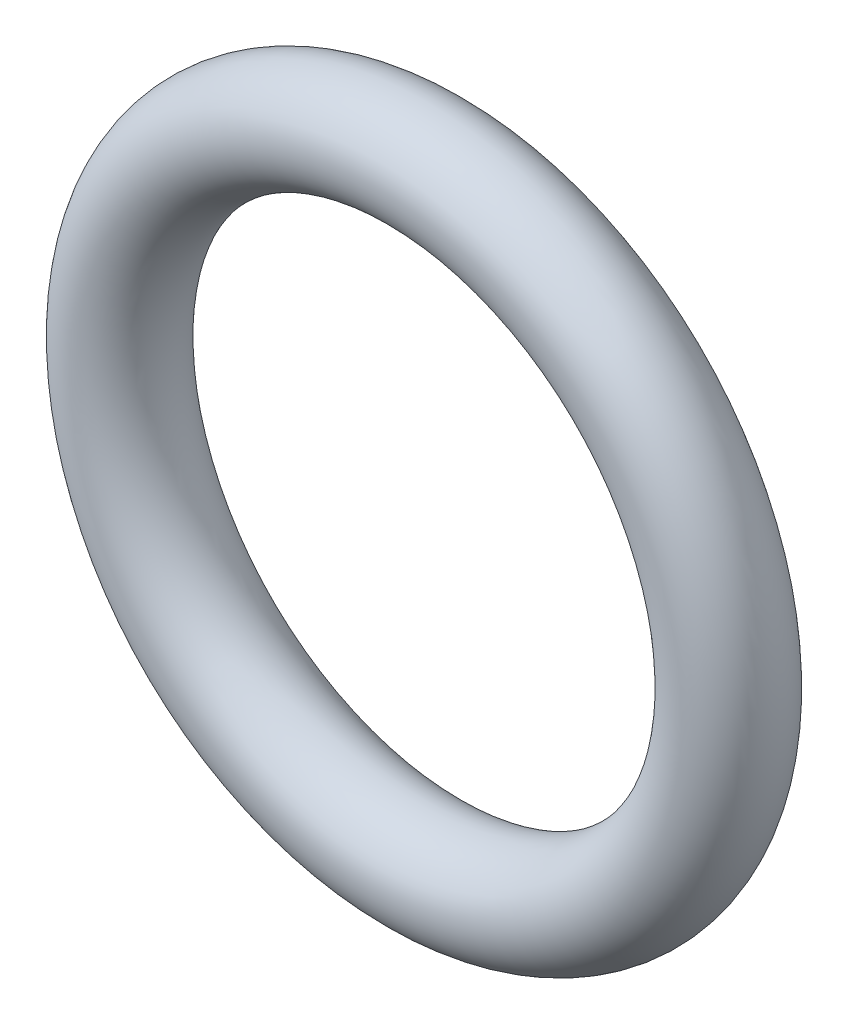
ISO-10303-21;
HEADER;
FILE_DESCRIPTION(('STEP AP214'),'2;1');
FILE_NAME('part.step','',(''),(''),'','','');
FILE_SCHEMA(('AUTOMOTIVE_DESIGN { 1 0 10303 214 1 1 1 1 }'));
ENDSEC;
DATA;
#1=APPLICATION_CONTEXT('core data for automotive mechanical design processes');
#2=APPLICATION_PROTOCOL_DEFINITION('international standard','automotive_design',2000,#1);
#3=PRODUCT_CONTEXT('',#1,'mechanical');
#4=PRODUCT('Part','Part','',(#3));
#5=PRODUCT_RELATED_PRODUCT_CATEGORY('part','',(#4));
#6=PRODUCT_DEFINITION_FORMATION('','',#4);
#7=PRODUCT_DEFINITION_CONTEXT('part definition',#1,'design');
#8=PRODUCT_DEFINITION('design','',#6,#7);
#9=PRODUCT_DEFINITION_SHAPE('','',#8);
#10=(LENGTH_UNIT() NAMED_UNIT(*) SI_UNIT(.MILLI.,.METRE.));
#11=(NAMED_UNIT(*) PLANE_ANGLE_UNIT() SI_UNIT($,.RADIAN.));
#12=(NAMED_UNIT(*) SI_UNIT($,.STERADIAN.) SOLID_ANGLE_UNIT());
#13=UNCERTAINTY_MEASURE_WITH_UNIT(LENGTH_MEASURE(1.E-05),#10,'distance_accuracy_value','');
#14=(GEOMETRIC_REPRESENTATION_CONTEXT(3) GLOBAL_UNCERTAINTY_ASSIGNED_CONTEXT((#13)) GLOBAL_UNIT_ASSIGNED_CONTEXT((#10,
#11,#12)) REPRESENTATION_CONTEXT('',''));
#15=CARTESIAN_POINT('',(0.,0.,0.));
#16=DIRECTION('',(0.,0.,1.));
#17=DIRECTION('',(1.,0.,0.));
#18=AXIS2_PLACEMENT_3D('',#15,#16,#17);
#19=CARTESIAN_POINT('',(0.,-13.39453125,0.));
#20=DIRECTION('',(0.,0.,1.));
#21=DIRECTION('',(1.,0.,0.));
#22=AXIS2_PLACEMENT_3D('',#19,#20,#21);
#23=TOROIDAL_SURFACE('',#22,13.39453125,2.28203125);
#24=CARTESIAN_POINT('',(0.,0.,0.));
#25=DIRECTION('',(1.,0.,0.));
#26=DIRECTION('',(0.,0.,-1.));
#27=AXIS2_PLACEMENT_3D('',#24,#25,#26);
#28=CIRCLE('',#27,2.28203125);
#29=CARTESIAN_POINT('',(0.,2.28203124999999,0.));
#30=VERTEX_POINT('',#29);
#31=EDGE_CURVE('E10',#30,#30,#28,.T.);
#32=CARTESIAN_POINT('',(0.,-13.39453125,0.));
#33=DIRECTION('',(0.,0.,1.));
#34=DIRECTION('',(1.,0.,0.));
#35=AXIS2_PLACEMENT_3D('',#32,#33,#34);
#36=CIRCLE('',#35,15.6765625);
#37=EDGE_CURVE('',#30,#30,#36,.T.);
#38=ORIENTED_EDGE('',*,*,#31,.F.);
#39=ORIENTED_EDGE('',*,*,#31,.T.);
#40=ORIENTED_EDGE('',*,*,#37,.T.);
#41=ORIENTED_EDGE('',*,*,#37,.F.);
#42=EDGE_LOOP('',(#38,#40,#39,#41));
#43=FACE_BOUND('',#42,.T.);
#44=ADVANCED_FACE('F30',(#43),#23,.T.);
#45=CLOSED_SHELL('',(#44));
#46=MANIFOLD_SOLID_BREP('B2',#45);
#47=ADVANCED_BREP_SHAPE_REPRESENTATION('',(#18,#46),#14);
#48=SHAPE_DEFINITION_REPRESENTATION(#9,#47);
ENDSEC;
END-ISO-10303-21;
